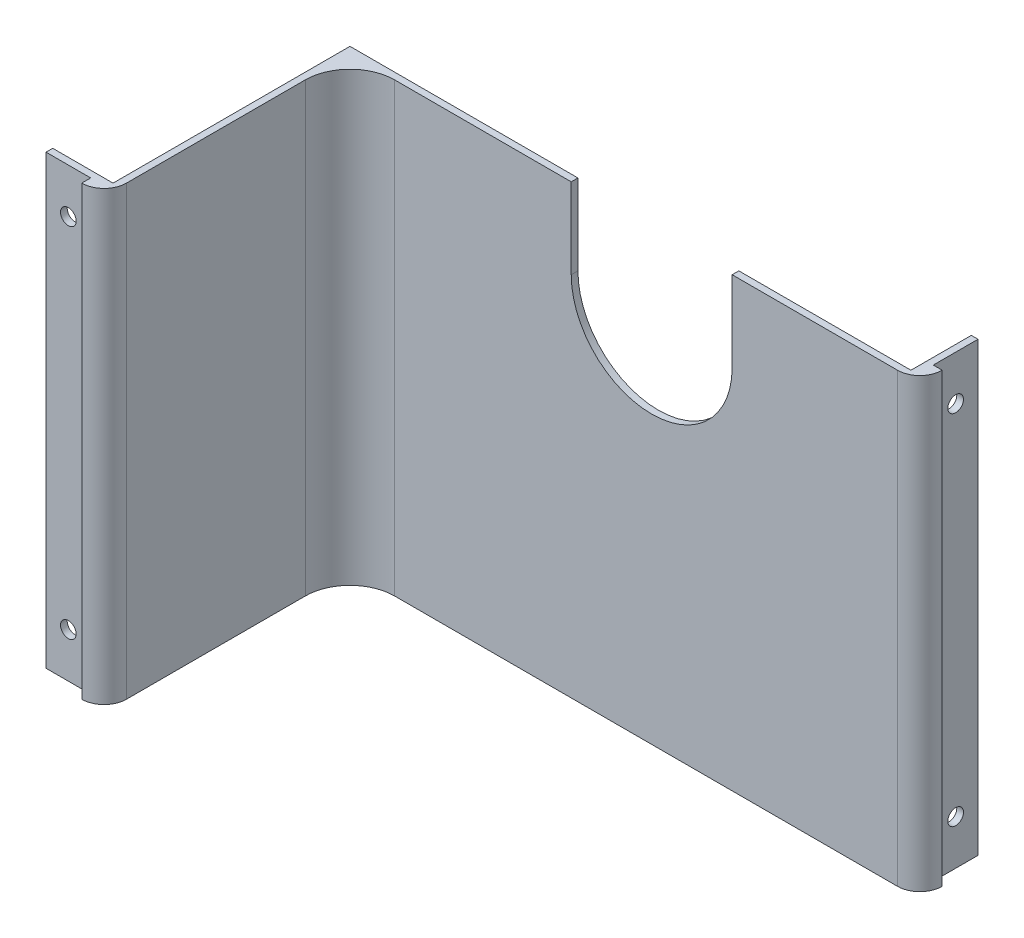
ISO-10303-21;
HEADER;
FILE_DESCRIPTION(('STEP AP214'),'2;1');
FILE_NAME('part.step','',(''),(''),'','','');
FILE_SCHEMA(('AUTOMOTIVE_DESIGN { 1 0 10303 214 1 1 1 1 }'));
ENDSEC;
DATA;
#1=APPLICATION_CONTEXT('core data for automotive mechanical design processes');
#2=APPLICATION_PROTOCOL_DEFINITION('international standard','automotive_design',2000,#1);
#3=PRODUCT_CONTEXT('',#1,'mechanical');
#4=PRODUCT('Part','Part','',(#3));
#5=PRODUCT_RELATED_PRODUCT_CATEGORY('part','',(#4));
#6=PRODUCT_DEFINITION_FORMATION('','',#4);
#7=PRODUCT_DEFINITION_CONTEXT('part definition',#1,'design');
#8=PRODUCT_DEFINITION('design','',#6,#7);
#9=PRODUCT_DEFINITION_SHAPE('','',#8);
#10=(LENGTH_UNIT() NAMED_UNIT(*) SI_UNIT(.MILLI.,.METRE.));
#11=(NAMED_UNIT(*) PLANE_ANGLE_UNIT() SI_UNIT($,.RADIAN.));
#12=(NAMED_UNIT(*) SI_UNIT($,.STERADIAN.) SOLID_ANGLE_UNIT());
#13=UNCERTAINTY_MEASURE_WITH_UNIT(LENGTH_MEASURE(1.E-05),#10,'distance_accuracy_value','');
#14=(GEOMETRIC_REPRESENTATION_CONTEXT(3) GLOBAL_UNCERTAINTY_ASSIGNED_CONTEXT((#13)) GLOBAL_UNIT_ASSIGNED_CONTEXT((#10,
#11,#12)) REPRESENTATION_CONTEXT('',''));
#15=CARTESIAN_POINT('',(0.,0.,0.));
#16=DIRECTION('',(0.,0.,1.));
#17=DIRECTION('',(1.,0.,0.));
#18=AXIS2_PLACEMENT_3D('',#15,#16,#17);
#19=CARTESIAN_POINT('',(-6.10622663543836E-13,100.,-4.99999999999999));
#20=DIRECTION('',(0.,1.,0.));
#21=DIRECTION('',(0.,0.,1.));
#22=AXIS2_PLACEMENT_3D('',#19,#20,#21);
#23=PLANE('',#22);
#24=DIRECTION('',(0.,0.,1.));
#25=VECTOR('',#24,1.);
#26=CARTESIAN_POINT('',(-73.,100.,-5.));
#27=LINE('',#26,#25);
#28=CARTESIAN_POINT('',(-73.,100.,-1.5));
#29=VERTEX_POINT('',#28);
#30=CARTESIAN_POINT('',(-73.0000000000003,100.,0.));
#31=VERTEX_POINT('',#30);
#32=EDGE_CURVE('E11',#29,#31,#27,.T.);
#33=ORIENTED_EDGE('',*,*,#32,.F.);
#34=DIRECTION('',(-1.,0.,0.));
#35=VECTOR('',#34,1.);
#36=CARTESIAN_POINT('',(-124.,100.,-1.49999999999999));
#37=LINE('',#36,#35);
#38=CARTESIAN_POINT('',(-124.,100.,-1.49999999999999));
#39=VERTEX_POINT('',#38);
#40=EDGE_CURVE('E302',#29,#39,#37,.T.);
#41=ORIENTED_EDGE('',*,*,#40,.T.);
#42=DIRECTION('',(0.,0.,1.));
#43=VECTOR('',#42,1.);
#44=CARTESIAN_POINT('',(-124.,100.,51.5));
#45=LINE('',#44,#43);
#46=CARTESIAN_POINT('',(-124.,100.,51.5));
#47=VERTEX_POINT('',#46);
#48=EDGE_CURVE('E306',#39,#47,#45,.T.);
#49=ORIENTED_EDGE('',*,*,#48,.T.);
#50=DIRECTION('',(-1.,0.,0.));
#51=VECTOR('',#50,1.);
#52=CARTESIAN_POINT('',(-137.5,100.,51.5));
#53=LINE('',#52,#51);
#54=CARTESIAN_POINT('',(-137.5,100.,51.5));
#55=VERTEX_POINT('',#54);
#56=EDGE_CURVE('E308',#47,#55,#53,.T.);
#57=ORIENTED_EDGE('',*,*,#56,.T.);
#58=DIRECTION('',(0.,0.,1.));
#59=VECTOR('',#58,1.);
#60=CARTESIAN_POINT('',(-137.5,100.,53.));
#61=LINE('',#60,#59);
#62=CARTESIAN_POINT('',(-137.5,100.,53.));
#63=VERTEX_POINT('',#62);
#64=EDGE_CURVE('E310',#55,#63,#61,.T.);
#65=ORIENTED_EDGE('',*,*,#64,.T.);
#66=DIRECTION('',(1.,0.,0.));
#67=VECTOR('',#66,1.);
#68=CARTESIAN_POINT('',(-127.5,100.,53.));
#69=LINE('',#68,#67);
#70=CARTESIAN_POINT('',(-127.5,100.,53.));
#71=VERTEX_POINT('',#70);
#72=EDGE_CURVE('E312',#63,#71,#69,.T.);
#73=ORIENTED_EDGE('',*,*,#72,.T.);
#74=DIRECTION('',(0.,0.,1.));
#75=VECTOR('',#74,1.);
#76=CARTESIAN_POINT('',(-127.5,100.,55.));
#77=LINE('',#76,#75);
#78=CARTESIAN_POINT('',(-127.5,100.,55.));
#79=VERTEX_POINT('',#78);
#80=EDGE_CURVE('E314',#71,#79,#77,.T.);
#81=ORIENTED_EDGE('',*,*,#80,.T.);
#82=CARTESIAN_POINT('',(-127.5,100.,50.));
#83=DIRECTION('',(0.,1.,0.));
#84=DIRECTION('',(0.,0.,-1.));
#85=AXIS2_PLACEMENT_3D('',#82,#83,#84);
#86=CIRCLE('',#85,5.00000000000001);
#87=CARTESIAN_POINT('',(-122.5,100.,50.));
#88=VERTEX_POINT('',#87);
#89=EDGE_CURVE('E168',#79,#88,#86,.T.);
#90=ORIENTED_EDGE('',*,*,#89,.T.);
#91=DIRECTION('',(0.,0.,-1.));
#92=VECTOR('',#91,1.);
#93=CARTESIAN_POINT('',(-122.5,100.,10.));
#94=LINE('',#93,#92);
#95=CARTESIAN_POINT('',(-122.5,100.,9.99999999999999));
#96=VERTEX_POINT('',#95);
#97=EDGE_CURVE('E160',#88,#96,#94,.T.);
#98=ORIENTED_EDGE('',*,*,#97,.T.);
#99=CARTESIAN_POINT('',(-112.5,100.,10.));
#100=DIRECTION('',(0.,-1.,0.));
#101=DIRECTION('',(0.,0.,1.));
#102=AXIS2_PLACEMENT_3D('',#99,#100,#101);
#103=CIRCLE('',#102,9.99999999999999);
#104=CARTESIAN_POINT('',(-112.5,100.,0.));
#105=VERTEX_POINT('',#104);
#106=EDGE_CURVE('E165',#96,#105,#103,.T.);
#107=ORIENTED_EDGE('',*,*,#106,.T.);
#108=DIRECTION('',(1.,0.,0.));
#109=VECTOR('',#108,1.);
#110=CARTESIAN_POINT('',(0.,100.,0.));
#111=LINE('',#110,#109);
#112=EDGE_CURVE('E186',#105,#31,#111,.T.);
#113=ORIENTED_EDGE('',*,*,#112,.T.);
#114=EDGE_LOOP('',(#33,#41,#49,#57,#65,#73,#81,#90,#98,#107,#113));
#115=FACE_BOUND('',#114,.T.);
#116=ADVANCED_FACE('F34',(#115),#23,.T.);
#117=CARTESIAN_POINT('',(-6.10622663543836E-13,100.,-4.99999999999999));
#118=DIRECTION('',(0.,-1.,0.));
#119=DIRECTION('',(0.,0.,-1.));
#120=AXIS2_PLACEMENT_3D('',#117,#118,#119);
#121=CYLINDRICAL_SURFACE('',#120,5.);
#122=CARTESIAN_POINT('',(-6.10622663543836E-13,3.05311331771918E-13,-5.));
#123=DIRECTION('',(0.,1.,0.));
#124=DIRECTION('',(0.,0.,1.));
#125=AXIS2_PLACEMENT_3D('',#122,#123,#124);
#126=CIRCLE('',#125,5.);
#127=CARTESIAN_POINT('',(0.,0.,0.));
#128=VERTEX_POINT('',#127);
#129=CARTESIAN_POINT('',(4.99999999999939,3.05311331771918E-13,-5.00000000000002));
#130=VERTEX_POINT('',#129);
#131=EDGE_CURVE('E191',#128,#130,#126,.T.);
#132=ORIENTED_EDGE('',*,*,#131,.T.);
#133=DIRECTION('',(0.,-1.,0.));
#134=VECTOR('',#133,1.);
#135=CARTESIAN_POINT('',(4.99999999999939,100.,-5.));
#136=LINE('',#135,#134);
#137=CARTESIAN_POINT('',(4.99999999999939,100.,-5.));
#138=VERTEX_POINT('',#137);
#139=EDGE_CURVE('E255',#138,#130,#136,.T.);
#140=ORIENTED_EDGE('',*,*,#139,.F.);
#141=CARTESIAN_POINT('',(-6.10622663543836E-13,100.,-4.99999999999999));
#142=DIRECTION('',(0.,1.,0.));
#143=DIRECTION('',(0.,0.,1.));
#144=AXIS2_PLACEMENT_3D('',#141,#142,#143);
#145=CIRCLE('',#144,5.);
#146=CARTESIAN_POINT('',(0.,100.,0.));
#147=VERTEX_POINT('',#146);
#148=EDGE_CURVE('E221',#147,#138,#145,.T.);
#149=ORIENTED_EDGE('',*,*,#148,.F.);
#150=DIRECTION('',(0.,-1.,0.));
#151=VECTOR('',#150,1.);
#152=CARTESIAN_POINT('',(0.,100.,0.));
#153=LINE('',#152,#151);
#154=EDGE_CURVE('E190',#147,#128,#153,.T.);
#155=ORIENTED_EDGE('',*,*,#154,.T.);
#156=EDGE_LOOP('',(#132,#140,#149,#155));
#157=FACE_BOUND('',#156,.T.);
#158=ADVANCED_FACE('F36',(#157),#121,.T.);
#159=CARTESIAN_POINT('',(4.99999999999939,100.,-5.));
#160=DIRECTION('',(0.,0.,1.));
#161=DIRECTION('',(1.,0.,0.));
#162=AXIS2_PLACEMENT_3D('',#159,#160,#161);
#163=PLANE('',#162);
#164=DIRECTION('',(-1.,0.,0.));
#165=VECTOR('',#164,1.);
#166=CARTESIAN_POINT('',(4.99999999999939,3.05311331771918E-13,-5.00000000000002));
#167=LINE('',#166,#165);
#168=CARTESIAN_POINT('',(2.99999999999939,3.05311331771918E-13,-5.));
#169=VERTEX_POINT('',#168);
#170=EDGE_CURVE('E194',#130,#169,#167,.T.);
#171=ORIENTED_EDGE('',*,*,#170,.T.);
#172=DIRECTION('',(0.,-1.,0.));
#173=VECTOR('',#172,1.);
#174=CARTESIAN_POINT('',(2.99999999999939,100.,-5.));
#175=LINE('',#174,#173);
#176=CARTESIAN_POINT('',(2.99999999999939,100.,-5.));
#177=VERTEX_POINT('',#176);
#178=EDGE_CURVE('E252',#177,#169,#175,.T.);
#179=ORIENTED_EDGE('',*,*,#178,.F.);
#180=DIRECTION('',(-1.,0.,0.));
#181=VECTOR('',#180,1.);
#182=CARTESIAN_POINT('',(4.99999999999939,100.,-5.));
#183=LINE('',#182,#181);
#184=EDGE_CURVE('E123',#138,#177,#183,.T.);
#185=ORIENTED_EDGE('',*,*,#184,.F.);
#186=ORIENTED_EDGE('',*,*,#139,.T.);
#187=EDGE_LOOP('',(#171,#179,#185,#186));
#188=FACE_BOUND('',#187,.T.);
#189=ADVANCED_FACE('F390',(#188),#163,.F.);
#190=CARTESIAN_POINT('',(2.99999999999939,100.,-5.));
#191=DIRECTION('',(-1.,0.,0.));
#192=DIRECTION('',(0.,0.,1.));
#193=AXIS2_PLACEMENT_3D('',#190,#191,#192);
#194=PLANE('',#193);
#195=CARTESIAN_POINT('',(2.99999999999998,90.,-10.));
#196=DIRECTION('',(1.,0.,0.));
#197=DIRECTION('',(0.,0.,-1.));
#198=AXIS2_PLACEMENT_3D('',#195,#196,#197);
#199=CIRCLE('',#198,1.75);
#200=CARTESIAN_POINT('',(2.99999999999998,90.,-11.75));
#201=VERTEX_POINT('',#200);
#202=EDGE_CURVE('E259',#201,#201,#199,.T.);
#203=ORIENTED_EDGE('',*,*,#202,.F.);
#204=EDGE_LOOP('',(#203));
#205=FACE_BOUND('',#204,.T.);
#206=CARTESIAN_POINT('',(2.99999999999998,9.99999999999999,-10.));
#207=DIRECTION('',(1.,0.,0.));
#208=DIRECTION('',(0.,0.,1.));
#209=AXIS2_PLACEMENT_3D('',#206,#207,#208);
#210=CIRCLE('',#209,1.75);
#211=CARTESIAN_POINT('',(2.99999999999998,9.99999999999999,-8.25000000000002));
#212=VERTEX_POINT('',#211);
#213=EDGE_CURVE('E265',#212,#212,#210,.T.);
#214=ORIENTED_EDGE('',*,*,#213,.F.);
#215=EDGE_LOOP('',(#214));
#216=FACE_BOUND('',#215,.T.);
#217=DIRECTION('',(0.,0.,-1.));
#218=VECTOR('',#217,1.);
#219=CARTESIAN_POINT('',(2.99999999999939,3.05311331771918E-13,-5.));
#220=LINE('',#219,#218);
#221=CARTESIAN_POINT('',(3.,3.05311331771918E-13,-15.));
#222=VERTEX_POINT('',#221);
#223=EDGE_CURVE('E197',#169,#222,#220,.T.);
#224=ORIENTED_EDGE('',*,*,#223,.T.);
#225=DIRECTION('',(0.,-1.,0.));
#226=VECTOR('',#225,1.);
#227=CARTESIAN_POINT('',(3.,100.,-15.));
#228=LINE('',#227,#226);
#229=CARTESIAN_POINT('',(3.,100.,-15.));
#230=VERTEX_POINT('',#229);
#231=EDGE_CURVE('E249',#230,#222,#228,.T.);
#232=ORIENTED_EDGE('',*,*,#231,.F.);
#233=DIRECTION('',(0.,0.,-1.));
#234=VECTOR('',#233,1.);
#235=CARTESIAN_POINT('',(2.99999999999939,100.,-5.));
#236=LINE('',#235,#234);
#237=EDGE_CURVE('E296',#177,#230,#236,.T.);
#238=ORIENTED_EDGE('',*,*,#237,.F.);
#239=ORIENTED_EDGE('',*,*,#178,.T.);
#240=EDGE_LOOP('',(#224,#232,#238,#239));
#241=FACE_BOUND('',#240,.T.);
#242=ADVANCED_FACE('F388',(#205,#216,#241),#194,.F.);
#243=CARTESIAN_POINT('',(3.,100.,-15.));
#244=DIRECTION('',(0.,0.,1.));
#245=DIRECTION('',(1.,0.,0.));
#246=AXIS2_PLACEMENT_3D('',#243,#244,#245);
#247=PLANE('',#246);
#248=DIRECTION('',(-1.,0.,0.));
#249=VECTOR('',#248,1.);
#250=CARTESIAN_POINT('',(3.,3.05311331771918E-13,-15.));
#251=LINE('',#250,#249);
#252=CARTESIAN_POINT('',(1.5,3.05311331771918E-13,-15.));
#253=VERTEX_POINT('',#252);
#254=EDGE_CURVE('E199',#222,#253,#251,.T.);
#255=ORIENTED_EDGE('',*,*,#254,.T.);
#256=DIRECTION('',(0.,-1.,0.));
#257=VECTOR('',#256,1.);
#258=CARTESIAN_POINT('',(1.5,100.,-15.));
#259=LINE('',#258,#257);
#260=CARTESIAN_POINT('',(1.5,100.,-15.));
#261=VERTEX_POINT('',#260);
#262=EDGE_CURVE('E246',#261,#253,#259,.T.);
#263=ORIENTED_EDGE('',*,*,#262,.F.);
#264=DIRECTION('',(-1.,0.,0.));
#265=VECTOR('',#264,1.);
#266=CARTESIAN_POINT('',(3.,100.,-15.));
#267=LINE('',#266,#265);
#268=EDGE_CURVE('E298',#230,#261,#267,.T.);
#269=ORIENTED_EDGE('',*,*,#268,.F.);
#270=ORIENTED_EDGE('',*,*,#231,.T.);
#271=EDGE_LOOP('',(#255,#263,#269,#270));
#272=FACE_BOUND('',#271,.T.);
#273=ADVANCED_FACE('F384',(#272),#247,.F.);
#274=CARTESIAN_POINT('',(1.5,100.,-15.));
#275=DIRECTION('',(1.,0.,0.));
#276=DIRECTION('',(0.,0.,-1.));
#277=AXIS2_PLACEMENT_3D('',#274,#275,#276);
#278=PLANE('',#277);
#279=CARTESIAN_POINT('',(1.49999999999997,90.,-10.));
#280=DIRECTION('',(1.,0.,0.));
#281=DIRECTION('',(0.,0.,-1.));
#282=AXIS2_PLACEMENT_3D('',#279,#280,#281);
#283=CIRCLE('',#282,1.75);
#284=CARTESIAN_POINT('',(1.49999999999997,90.,-11.75));
#285=VERTEX_POINT('',#284);
#286=EDGE_CURVE('E38',#285,#285,#283,.T.);
#287=ORIENTED_EDGE('',*,*,#286,.T.);
#288=EDGE_LOOP('',(#287));
#289=FACE_BOUND('',#288,.T.);
#290=CARTESIAN_POINT('',(1.49999999999997,9.99999999999999,-10.));
#291=DIRECTION('',(1.,0.,0.));
#292=DIRECTION('',(0.,0.,-1.));
#293=AXIS2_PLACEMENT_3D('',#290,#291,#292);
#294=CIRCLE('',#293,1.75);
#295=CARTESIAN_POINT('',(1.49999999999997,9.99999999999999,-11.75));
#296=VERTEX_POINT('',#295);
#297=EDGE_CURVE('E257',#296,#296,#294,.T.);
#298=ORIENTED_EDGE('',*,*,#297,.T.);
#299=EDGE_LOOP('',(#298));
#300=FACE_BOUND('',#299,.T.);
#301=DIRECTION('',(0.,0.,1.));
#302=VECTOR('',#301,1.);
#303=CARTESIAN_POINT('',(1.5,3.05311331771918E-13,-15.));
#304=LINE('',#303,#302);
#305=CARTESIAN_POINT('',(1.49999999999939,3.05311331771918E-13,-1.5));
#306=VERTEX_POINT('',#305);
#307=EDGE_CURVE('E201',#253,#306,#304,.T.);
#308=ORIENTED_EDGE('',*,*,#307,.T.);
#309=DIRECTION('',(0.,-1.,0.));
#310=VECTOR('',#309,1.);
#311=CARTESIAN_POINT('',(1.49999999999939,100.,-1.5));
#312=LINE('',#311,#310);
#313=CARTESIAN_POINT('',(1.49999999999939,100.,-1.5));
#314=VERTEX_POINT('',#313);
#315=EDGE_CURVE('E243',#314,#306,#312,.T.);
#316=ORIENTED_EDGE('',*,*,#315,.F.);
#317=DIRECTION('',(0.,0.,1.));
#318=VECTOR('',#317,1.);
#319=CARTESIAN_POINT('',(1.5,100.,-15.));
#320=LINE('',#319,#318);
#321=EDGE_CURVE('E300',#261,#314,#320,.T.);
#322=ORIENTED_EDGE('',*,*,#321,.F.);
#323=ORIENTED_EDGE('',*,*,#262,.T.);
#324=EDGE_LOOP('',(#308,#316,#322,#323));
#325=FACE_BOUND('',#324,.T.);
#326=ADVANCED_FACE('F380',(#289,#300,#325),#278,.F.);
#327=CARTESIAN_POINT('',(-124.,100.,-1.49999999999999));
#328=DIRECTION('',(0.,0.,1.));
#329=DIRECTION('',(1.,0.,0.));
#330=AXIS2_PLACEMENT_3D('',#327,#328,#329);
#331=PLANE('',#330);
#332=ORIENTED_EDGE('',*,*,#40,.F.);
#333=DIRECTION('',(0.,-1.,0.));
#334=VECTOR('',#333,1.);
#335=CARTESIAN_POINT('',(-73.,100.,-1.5));
#336=LINE('',#335,#334);
#337=CARTESIAN_POINT('',(-73.,82.,-1.5));
#338=VERTEX_POINT('',#337);
#339=EDGE_CURVE('E289',#29,#338,#336,.T.);
#340=ORIENTED_EDGE('',*,*,#339,.T.);
#341=CARTESIAN_POINT('',(-55.,82.0000008613909,-1.5));
#342=DIRECTION('',(0.,0.,1.));
#343=DIRECTION('',(1.,0.,0.));
#344=AXIS2_PLACEMENT_3D('',#341,#342,#343);
#345=CIRCLE('',#344,18.);
#346=CARTESIAN_POINT('',(-37.,82.0000017227817,-1.5));
#347=VERTEX_POINT('',#346);
#348=EDGE_CURVE('E195',#338,#347,#345,.T.);
#349=ORIENTED_EDGE('',*,*,#348,.T.);
#350=DIRECTION('',(0.,1.,0.));
#351=VECTOR('',#350,1.);
#352=CARTESIAN_POINT('',(-37.,100.,-1.5));
#353=LINE('',#352,#351);
#354=CARTESIAN_POINT('',(-37.,100.,-1.5));
#355=VERTEX_POINT('',#354);
#356=EDGE_CURVE('E285',#347,#355,#353,.T.);
#357=ORIENTED_EDGE('',*,*,#356,.T.);
#358=EDGE_CURVE('E303',#314,#355,#37,.T.);
#359=ORIENTED_EDGE('',*,*,#358,.F.);
#360=ORIENTED_EDGE('',*,*,#315,.T.);
#361=DIRECTION('',(-1.,0.,0.));
#362=VECTOR('',#361,1.);
#363=CARTESIAN_POINT('',(-124.,3.05311331771918E-13,-1.5));
#364=LINE('',#363,#362);
#365=CARTESIAN_POINT('',(-124.,3.05311331771918E-13,-1.5));
#366=VERTEX_POINT('',#365);
#367=EDGE_CURVE('E203',#306,#366,#364,.T.);
#368=ORIENTED_EDGE('',*,*,#367,.T.);
#369=DIRECTION('',(0.,-1.,0.));
#370=VECTOR('',#369,1.);
#371=CARTESIAN_POINT('',(-124.,100.,-1.49999999999999));
#372=LINE('',#371,#370);
#373=EDGE_CURVE('E240',#39,#366,#372,.T.);
#374=ORIENTED_EDGE('',*,*,#373,.F.);
#375=EDGE_LOOP('',(#332,#340,#349,#357,#359,#360,#368,#374));
#376=FACE_BOUND('',#375,.T.);
#377=ADVANCED_FACE('F353',(#376),#331,.F.);
#378=CARTESIAN_POINT('',(-124.,100.,51.5));
#379=DIRECTION('',(1.,0.,0.));
#380=DIRECTION('',(0.,0.,-1.));
#381=AXIS2_PLACEMENT_3D('',#378,#379,#380);
#382=PLANE('',#381);
#383=DIRECTION('',(0.,0.,1.));
#384=VECTOR('',#383,1.);
#385=CARTESIAN_POINT('',(-124.,0.,51.5));
#386=LINE('',#385,#384);
#387=CARTESIAN_POINT('',(-124.,0.,51.5));
#388=VERTEX_POINT('',#387);
#389=EDGE_CURVE('E205',#366,#388,#386,.T.);
#390=ORIENTED_EDGE('',*,*,#389,.T.);
#391=DIRECTION('',(0.,-1.,0.));
#392=VECTOR('',#391,1.);
#393=CARTESIAN_POINT('',(-124.,100.,51.5));
#394=LINE('',#393,#392);
#395=EDGE_CURVE('E237',#47,#388,#394,.T.);
#396=ORIENTED_EDGE('',*,*,#395,.F.);
#397=ORIENTED_EDGE('',*,*,#48,.F.);
#398=ORIENTED_EDGE('',*,*,#373,.T.);
#399=EDGE_LOOP('',(#390,#396,#397,#398));
#400=FACE_BOUND('',#399,.T.);
#401=ADVANCED_FACE('F360',(#400),#382,.F.);
#402=CARTESIAN_POINT('',(-137.5,100.,51.5));
#403=DIRECTION('',(0.,0.,1.));
#404=DIRECTION('',(1.,0.,0.));
#405=AXIS2_PLACEMENT_3D('',#402,#403,#404);
#406=PLANE('',#405);
#407=CARTESIAN_POINT('',(-132.5,90.,51.5));
#408=DIRECTION('',(0.,0.,1.));
#409=DIRECTION('',(1.,0.,0.));
#410=AXIS2_PLACEMENT_3D('',#407,#408,#409);
#411=CIRCLE('',#410,1.75000000000001);
#412=CARTESIAN_POINT('',(-130.75,90.,51.5));
#413=VERTEX_POINT('',#412);
#414=EDGE_CURVE('E270',#413,#413,#411,.T.);
#415=ORIENTED_EDGE('',*,*,#414,.T.);
#416=EDGE_LOOP('',(#415));
#417=FACE_BOUND('',#416,.T.);
#418=CARTESIAN_POINT('',(-132.5,9.99999999999999,51.5));
#419=DIRECTION('',(0.,0.,1.));
#420=DIRECTION('',(1.,0.,0.));
#421=AXIS2_PLACEMENT_3D('',#418,#419,#420);
#422=CIRCLE('',#421,1.75000000000001);
#423=CARTESIAN_POINT('',(-130.75,9.99999999999999,51.5));
#424=VERTEX_POINT('',#423);
#425=EDGE_CURVE('E579',#424,#424,#422,.T.);
#426=ORIENTED_EDGE('',*,*,#425,.T.);
#427=EDGE_LOOP('',(#426));
#428=FACE_BOUND('',#427,.T.);
#429=DIRECTION('',(-1.,0.,0.));
#430=VECTOR('',#429,1.);
#431=CARTESIAN_POINT('',(-137.5,0.,51.5));
#432=LINE('',#431,#430);
#433=CARTESIAN_POINT('',(-137.5,0.,51.5));
#434=VERTEX_POINT('',#433);
#435=EDGE_CURVE('E207',#388,#434,#432,.T.);
#436=ORIENTED_EDGE('',*,*,#435,.T.);
#437=DIRECTION('',(0.,-1.,0.));
#438=VECTOR('',#437,1.);
#439=CARTESIAN_POINT('',(-137.5,100.,51.5));
#440=LINE('',#439,#438);
#441=EDGE_CURVE('E234',#55,#434,#440,.T.);
#442=ORIENTED_EDGE('',*,*,#441,.F.);
#443=ORIENTED_EDGE('',*,*,#56,.F.);
#444=ORIENTED_EDGE('',*,*,#395,.T.);
#445=EDGE_LOOP('',(#436,#442,#443,#444));
#446=FACE_BOUND('',#445,.T.);
#447=ADVANCED_FACE('F364',(#417,#428,#446),#406,.F.);
#448=CARTESIAN_POINT('',(-137.5,100.,53.));
#449=DIRECTION('',(1.,0.,0.));
#450=DIRECTION('',(0.,0.,-1.));
#451=AXIS2_PLACEMENT_3D('',#448,#449,#450);
#452=PLANE('',#451);
#453=DIRECTION('',(0.,0.,1.));
#454=VECTOR('',#453,1.);
#455=CARTESIAN_POINT('',(-137.5,0.,53.));
#456=LINE('',#455,#454);
#457=CARTESIAN_POINT('',(-137.5,0.,53.));
#458=VERTEX_POINT('',#457);
#459=EDGE_CURVE('E209',#434,#458,#456,.T.);
#460=ORIENTED_EDGE('',*,*,#459,.T.);
#461=DIRECTION('',(0.,-1.,0.));
#462=VECTOR('',#461,1.);
#463=CARTESIAN_POINT('',(-137.5,100.,53.));
#464=LINE('',#463,#462);
#465=EDGE_CURVE('E231',#63,#458,#464,.T.);
#466=ORIENTED_EDGE('',*,*,#465,.F.);
#467=ORIENTED_EDGE('',*,*,#64,.F.);
#468=ORIENTED_EDGE('',*,*,#441,.T.);
#469=EDGE_LOOP('',(#460,#466,#467,#468));
#470=FACE_BOUND('',#469,.T.);
#471=ADVANCED_FACE('F369',(#470),#452,.F.);
#472=CARTESIAN_POINT('',(-127.5,100.,53.));
#473=DIRECTION('',(0.,0.,-1.));
#474=DIRECTION('',(-1.,0.,0.));
#475=AXIS2_PLACEMENT_3D('',#472,#473,#474);
#476=PLANE('',#475);
#477=CARTESIAN_POINT('',(-132.5,90.,53.0000000000001));
#478=DIRECTION('',(0.,0.,1.));
#479=DIRECTION('',(1.,0.,0.));
#480=AXIS2_PLACEMENT_3D('',#477,#478,#479);
#481=CIRCLE('',#480,1.75000000000001);
#482=CARTESIAN_POINT('',(-130.75,90.,53.0000000000001));
#483=VERTEX_POINT('',#482);
#484=EDGE_CURVE('E576',#483,#483,#481,.T.);
#485=ORIENTED_EDGE('',*,*,#484,.F.);
#486=EDGE_LOOP('',(#485));
#487=FACE_BOUND('',#486,.T.);
#488=CARTESIAN_POINT('',(-132.5,9.99999999999999,53.0000000000001));
#489=DIRECTION('',(0.,0.,1.));
#490=DIRECTION('',(-1.,0.,0.));
#491=AXIS2_PLACEMENT_3D('',#488,#489,#490);
#492=CIRCLE('',#491,1.75000000000001);
#493=CARTESIAN_POINT('',(-134.25,9.99999999999999,53.0000000000001));
#494=VERTEX_POINT('',#493);
#495=EDGE_CURVE('E583',#494,#494,#492,.T.);
#496=ORIENTED_EDGE('',*,*,#495,.F.);
#497=EDGE_LOOP('',(#496));
#498=FACE_BOUND('',#497,.T.);
#499=DIRECTION('',(1.,0.,0.));
#500=VECTOR('',#499,1.);
#501=CARTESIAN_POINT('',(-127.5,0.,53.));
#502=LINE('',#501,#500);
#503=CARTESIAN_POINT('',(-127.5,0.,53.));
#504=VERTEX_POINT('',#503);
#505=EDGE_CURVE('E211',#458,#504,#502,.T.);
#506=ORIENTED_EDGE('',*,*,#505,.T.);
#507=DIRECTION('',(0.,-1.,0.));
#508=VECTOR('',#507,1.);
#509=CARTESIAN_POINT('',(-127.5,100.,53.));
#510=LINE('',#509,#508);
#511=EDGE_CURVE('E228',#71,#504,#510,.T.);
#512=ORIENTED_EDGE('',*,*,#511,.F.);
#513=ORIENTED_EDGE('',*,*,#72,.F.);
#514=ORIENTED_EDGE('',*,*,#465,.T.);
#515=EDGE_LOOP('',(#506,#512,#513,#514));
#516=FACE_BOUND('',#515,.T.);
#517=ADVANCED_FACE('F372',(#487,#498,#516),#476,.F.);
#518=CARTESIAN_POINT('',(-127.5,100.,55.));
#519=DIRECTION('',(1.,0.,0.));
#520=DIRECTION('',(0.,0.,-1.));
#521=AXIS2_PLACEMENT_3D('',#518,#519,#520);
#522=PLANE('',#521);
#523=DIRECTION('',(0.,0.,1.));
#524=VECTOR('',#523,1.);
#525=CARTESIAN_POINT('',(-127.5,0.,55.));
#526=LINE('',#525,#524);
#527=CARTESIAN_POINT('',(-127.5,0.,55.));
#528=VERTEX_POINT('',#527);
#529=EDGE_CURVE('E213',#504,#528,#526,.T.);
#530=ORIENTED_EDGE('',*,*,#529,.T.);
#531=DIRECTION('',(0.,-1.,0.));
#532=VECTOR('',#531,1.);
#533=CARTESIAN_POINT('',(-127.5,100.,55.));
#534=LINE('',#533,#532);
#535=EDGE_CURVE('E225',#79,#528,#534,.T.);
#536=ORIENTED_EDGE('',*,*,#535,.F.);
#537=ORIENTED_EDGE('',*,*,#80,.F.);
#538=ORIENTED_EDGE('',*,*,#511,.T.);
#539=EDGE_LOOP('',(#530,#536,#537,#538));
#540=FACE_BOUND('',#539,.T.);
#541=ADVANCED_FACE('F320',(#540),#522,.F.);
#542=CARTESIAN_POINT('',(-127.5,100.,50.));
#543=DIRECTION('',(0.,-1.,0.));
#544=DIRECTION('',(0.,0.,-1.));
#545=AXIS2_PLACEMENT_3D('',#542,#543,#544);
#546=CYLINDRICAL_SURFACE('',#545,5.00000000000001);
#547=CARTESIAN_POINT('',(-127.5,3.05311331771918E-13,50.));
#548=DIRECTION('',(0.,1.,0.));
#549=DIRECTION('',(0.,0.,-1.));
#550=AXIS2_PLACEMENT_3D('',#547,#548,#549);
#551=CIRCLE('',#550,5.00000000000001);
#552=CARTESIAN_POINT('',(-122.5,3.05311331771918E-13,50.));
#553=VERTEX_POINT('',#552);
#554=EDGE_CURVE('E215',#528,#553,#551,.T.);
#555=ORIENTED_EDGE('',*,*,#554,.T.);
#556=DIRECTION('',(0.,-1.,0.));
#557=VECTOR('',#556,1.);
#558=CARTESIAN_POINT('',(-122.5,100.,50.));
#559=LINE('',#558,#557);
#560=EDGE_CURVE('E180',#88,#553,#559,.T.);
#561=ORIENTED_EDGE('',*,*,#560,.F.);
#562=ORIENTED_EDGE('',*,*,#89,.F.);
#563=ORIENTED_EDGE('',*,*,#535,.T.);
#564=EDGE_LOOP('',(#555,#561,#562,#563));
#565=FACE_BOUND('',#564,.T.);
#566=ADVANCED_FACE('F324',(#565),#546,.T.);
#567=CARTESIAN_POINT('',(-122.5,100.,10.));
#568=DIRECTION('',(-1.,0.,0.));
#569=DIRECTION('',(0.,0.,1.));
#570=AXIS2_PLACEMENT_3D('',#567,#568,#569);
#571=PLANE('',#570);
#572=DIRECTION('',(0.,0.,-1.));
#573=VECTOR('',#572,1.);
#574=CARTESIAN_POINT('',(-122.5,0.,10.));
#575=LINE('',#574,#573);
#576=CARTESIAN_POINT('',(-122.5,0.,10.));
#577=VERTEX_POINT('',#576);
#578=EDGE_CURVE('E177',#553,#577,#575,.T.);
#579=ORIENTED_EDGE('',*,*,#578,.T.);
#580=DIRECTION('',(0.,-1.,0.));
#581=VECTOR('',#580,1.);
#582=CARTESIAN_POINT('',(-122.5,100.,9.99999999999999));
#583=LINE('',#582,#581);
#584=EDGE_CURVE('E174',#96,#577,#583,.T.);
#585=ORIENTED_EDGE('',*,*,#584,.F.);
#586=ORIENTED_EDGE('',*,*,#97,.F.);
#587=ORIENTED_EDGE('',*,*,#560,.T.);
#588=EDGE_LOOP('',(#579,#585,#586,#587));
#589=FACE_BOUND('',#588,.T.);
#590=ADVANCED_FACE('F175',(#589),#571,.F.);
#591=CARTESIAN_POINT('',(-112.5,100.,10.));
#592=DIRECTION('',(0.,-1.,0.));
#593=DIRECTION('',(0.,0.,-1.));
#594=AXIS2_PLACEMENT_3D('',#591,#592,#593);
#595=CYLINDRICAL_SURFACE('',#594,9.99999999999999);
#596=CARTESIAN_POINT('',(-112.5,0.,10.));
#597=DIRECTION('',(0.,-1.,0.));
#598=DIRECTION('',(0.,0.,1.));
#599=AXIS2_PLACEMENT_3D('',#596,#597,#598);
#600=CIRCLE('',#599,9.99999999999999);
#601=CARTESIAN_POINT('',(-112.5,0.,0.));
#602=VERTEX_POINT('',#601);
#603=EDGE_CURVE('E218',#577,#602,#600,.T.);
#604=ORIENTED_EDGE('',*,*,#603,.T.);
#605=DIRECTION('',(0.,-1.,0.));
#606=VECTOR('',#605,1.);
#607=CARTESIAN_POINT('',(-112.5,100.,0.));
#608=LINE('',#607,#606);
#609=EDGE_CURVE('E181',#105,#602,#608,.T.);
#610=ORIENTED_EDGE('',*,*,#609,.F.);
#611=ORIENTED_EDGE('',*,*,#106,.F.);
#612=ORIENTED_EDGE('',*,*,#584,.T.);
#613=EDGE_LOOP('',(#604,#610,#611,#612));
#614=FACE_BOUND('',#613,.T.);
#615=ADVANCED_FACE('F183',(#614),#595,.F.);
#616=CARTESIAN_POINT('',(0.,100.,0.));
#617=DIRECTION('',(0.,0.,-1.));
#618=DIRECTION('',(-1.,0.,0.));
#619=AXIS2_PLACEMENT_3D('',#616,#617,#618);
#620=PLANE('',#619);
#621=CARTESIAN_POINT('',(-55.,82.0000008613909,0.));
#622=DIRECTION('',(0.,0.,1.));
#623=DIRECTION('',(1.,0.,0.));
#624=AXIS2_PLACEMENT_3D('',#621,#622,#623);
#625=CIRCLE('',#624,18.);
#626=CARTESIAN_POINT('',(-73.0000000000003,82.,0.));
#627=VERTEX_POINT('',#626);
#628=CARTESIAN_POINT('',(-37.,82.0000017227817,0.));
#629=VERTEX_POINT('',#628);
#630=EDGE_CURVE('E263',#627,#629,#625,.T.);
#631=ORIENTED_EDGE('',*,*,#630,.F.);
#632=DIRECTION('',(0.,-1.,0.));
#633=VECTOR('',#632,1.);
#634=CARTESIAN_POINT('',(-73.0000000000003,82.,0.));
#635=LINE('',#634,#633);
#636=EDGE_CURVE('E278',#31,#627,#635,.T.);
#637=ORIENTED_EDGE('',*,*,#636,.F.);
#638=ORIENTED_EDGE('',*,*,#112,.F.);
#639=ORIENTED_EDGE('',*,*,#609,.T.);
#640=DIRECTION('',(1.,0.,0.));
#641=VECTOR('',#640,1.);
#642=CARTESIAN_POINT('',(0.,0.,0.));
#643=LINE('',#642,#641);
#644=EDGE_CURVE('E114',#602,#128,#643,.T.);
#645=ORIENTED_EDGE('',*,*,#644,.T.);
#646=ORIENTED_EDGE('',*,*,#154,.F.);
#647=CARTESIAN_POINT('',(-37.,100.,0.));
#648=VERTEX_POINT('',#647);
#649=EDGE_CURVE('E59',#648,#147,#111,.T.);
#650=ORIENTED_EDGE('',*,*,#649,.F.);
#651=DIRECTION('',(0.,1.,0.));
#652=VECTOR('',#651,1.);
#653=CARTESIAN_POINT('',(-37.,100.,0.));
#654=LINE('',#653,#652);
#655=EDGE_CURVE('E51',#629,#648,#654,.T.);
#656=ORIENTED_EDGE('',*,*,#655,.F.);
#657=EDGE_LOOP('',(#631,#637,#638,#639,#645,#646,#650,#656));
#658=FACE_BOUND('',#657,.T.);
#659=ADVANCED_FACE('F329',(#658),#620,.F.);
#660=DIRECTION('',(0.,0.,-1.));
#661=VECTOR('',#660,1.);
#662=CARTESIAN_POINT('',(-37.0000000000006,100.,-5.));
#663=LINE('',#662,#661);
#664=EDGE_CURVE('E43',#648,#355,#663,.T.);
#665=ORIENTED_EDGE('',*,*,#664,.F.);
#666=ORIENTED_EDGE('',*,*,#649,.T.);
#667=ORIENTED_EDGE('',*,*,#148,.T.);
#668=ORIENTED_EDGE('',*,*,#184,.T.);
#669=ORIENTED_EDGE('',*,*,#237,.T.);
#670=ORIENTED_EDGE('',*,*,#268,.T.);
#671=ORIENTED_EDGE('',*,*,#321,.T.);
#672=ORIENTED_EDGE('',*,*,#358,.T.);
#673=EDGE_LOOP('',(#665,#666,#667,#668,#669,#670,#671,#672));
#674=FACE_BOUND('',#673,.T.);
#675=ADVANCED_FACE('F394',(#674),#23,.T.);
#676=CARTESIAN_POINT('',(-6.10622663543836E-13,3.05311331771918E-13,-5.));
#677=DIRECTION('',(0.,1.,0.));
#678=DIRECTION('',(0.,0.,1.));
#679=AXIS2_PLACEMENT_3D('',#676,#677,#678);
#680=PLANE('',#679);
#681=ORIENTED_EDGE('',*,*,#131,.F.);
#682=ORIENTED_EDGE('',*,*,#644,.F.);
#683=ORIENTED_EDGE('',*,*,#603,.F.);
#684=ORIENTED_EDGE('',*,*,#578,.F.);
#685=ORIENTED_EDGE('',*,*,#554,.F.);
#686=ORIENTED_EDGE('',*,*,#529,.F.);
#687=ORIENTED_EDGE('',*,*,#505,.F.);
#688=ORIENTED_EDGE('',*,*,#459,.F.);
#689=ORIENTED_EDGE('',*,*,#435,.F.);
#690=ORIENTED_EDGE('',*,*,#389,.F.);
#691=ORIENTED_EDGE('',*,*,#367,.F.);
#692=ORIENTED_EDGE('',*,*,#307,.F.);
#693=ORIENTED_EDGE('',*,*,#254,.F.);
#694=ORIENTED_EDGE('',*,*,#223,.F.);
#695=ORIENTED_EDGE('',*,*,#170,.F.);
#696=EDGE_LOOP('',(#681,#682,#683,#684,#685,#686,#687,#688,#689,#690,#691,#692,#693,#694,#695));
#697=FACE_BOUND('',#696,.T.);
#698=ADVANCED_FACE('F327',(#697),#680,.F.);
#699=CARTESIAN_POINT('',(-55.,82.0000008613909,-10.));
#700=DIRECTION('',(0.,0.,1.));
#701=DIRECTION('',(1.,0.,0.));
#702=AXIS2_PLACEMENT_3D('',#699,#700,#701);
#703=CYLINDRICAL_SURFACE('',#702,18.);
#704=DIRECTION('',(0.,0.,1.));
#705=VECTOR('',#704,1.);
#706=CARTESIAN_POINT('',(-73.0000000000003,82.,-10.));
#707=LINE('',#706,#705);
#708=EDGE_CURVE('E282',#338,#627,#707,.T.);
#709=ORIENTED_EDGE('',*,*,#708,.T.);
#710=ORIENTED_EDGE('',*,*,#630,.T.);
#711=DIRECTION('',(0.,0.,1.));
#712=VECTOR('',#711,1.);
#713=CARTESIAN_POINT('',(-37.,82.0000017227817,-10.));
#714=LINE('',#713,#712);
#715=EDGE_CURVE('E281',#347,#629,#714,.T.);
#716=ORIENTED_EDGE('',*,*,#715,.F.);
#717=ORIENTED_EDGE('',*,*,#348,.F.);
#718=EDGE_LOOP('',(#709,#710,#716,#717));
#719=FACE_BOUND('',#718,.T.);
#720=ADVANCED_FACE('F350',(#719),#703,.F.);
#721=CARTESIAN_POINT('',(-73.0000000000003,82.,-10.));
#722=DIRECTION('',(-1.,0.,0.));
#723=DIRECTION('',(0.,0.,1.));
#724=AXIS2_PLACEMENT_3D('',#721,#722,#723);
#725=PLANE('',#724);
#726=ORIENTED_EDGE('',*,*,#32,.T.);
#727=ORIENTED_EDGE('',*,*,#636,.T.);
#728=ORIENTED_EDGE('',*,*,#708,.F.);
#729=ORIENTED_EDGE('',*,*,#339,.F.);
#730=EDGE_LOOP('',(#726,#727,#728,#729));
#731=FACE_BOUND('',#730,.T.);
#732=ADVANCED_FACE('F352',(#731),#725,.F.);
#733=CARTESIAN_POINT('',(-37.,100.,-10.));
#734=DIRECTION('',(1.,0.,0.));
#735=DIRECTION('',(0.,0.,-1.));
#736=AXIS2_PLACEMENT_3D('',#733,#734,#735);
#737=PLANE('',#736);
#738=ORIENTED_EDGE('',*,*,#715,.T.);
#739=ORIENTED_EDGE('',*,*,#655,.T.);
#740=ORIENTED_EDGE('',*,*,#664,.T.);
#741=ORIENTED_EDGE('',*,*,#356,.F.);
#742=EDGE_LOOP('',(#738,#739,#740,#741));
#743=FACE_BOUND('',#742,.T.);
#744=ADVANCED_FACE('F395',(#743),#737,.F.);
#745=CARTESIAN_POINT('',(-7.00000000000001,9.99999999999999,-10.));
#746=DIRECTION('',(1.,0.,0.));
#747=DIRECTION('',(0.,0.,-1.));
#748=AXIS2_PLACEMENT_3D('',#745,#746,#747);
#749=CYLINDRICAL_SURFACE('',#748,1.75);
#750=ORIENTED_EDGE('',*,*,#213,.T.);
#751=EDGE_LOOP('',(#750));
#752=FACE_BOUND('',#751,.T.);
#753=ORIENTED_EDGE('',*,*,#297,.F.);
#754=EDGE_LOOP('',(#753));
#755=FACE_BOUND('',#754,.T.);
#756=ADVANCED_FACE('F397',(#752,#755),#749,.F.);
#757=CARTESIAN_POINT('',(-7.00000000000001,90.,-10.));
#758=DIRECTION('',(1.,0.,0.));
#759=DIRECTION('',(0.,0.,-1.));
#760=AXIS2_PLACEMENT_3D('',#757,#758,#759);
#761=CYLINDRICAL_SURFACE('',#760,1.75);
#762=ORIENTED_EDGE('',*,*,#202,.T.);
#763=EDGE_LOOP('',(#762));
#764=FACE_BOUND('',#763,.T.);
#765=ORIENTED_EDGE('',*,*,#286,.F.);
#766=EDGE_LOOP('',(#765));
#767=FACE_BOUND('',#766,.T.);
#768=ADVANCED_FACE('F403',(#764,#767),#761,.F.);
#769=CARTESIAN_POINT('',(-132.5,9.99999999999999,43.0000000000001));
#770=DIRECTION('',(0.,0.,1.));
#771=DIRECTION('',(1.,0.,0.));
#772=AXIS2_PLACEMENT_3D('',#769,#770,#771);
#773=CYLINDRICAL_SURFACE('',#772,1.75000000000001);
#774=ORIENTED_EDGE('',*,*,#495,.T.);
#775=EDGE_LOOP('',(#774));
#776=FACE_BOUND('',#775,.T.);
#777=ORIENTED_EDGE('',*,*,#425,.F.);
#778=EDGE_LOOP('',(#777));
#779=FACE_BOUND('',#778,.T.);
#780=ADVANCED_FACE('F550',(#776,#779),#773,.F.);
#781=CARTESIAN_POINT('',(-132.5,90.,43.0000000000001));
#782=DIRECTION('',(0.,0.,1.));
#783=DIRECTION('',(1.,0.,0.));
#784=AXIS2_PLACEMENT_3D('',#781,#782,#783);
#785=CYLINDRICAL_SURFACE('',#784,1.75000000000001);
#786=ORIENTED_EDGE('',*,*,#484,.T.);
#787=EDGE_LOOP('',(#786));
#788=FACE_BOUND('',#787,.T.);
#789=ORIENTED_EDGE('',*,*,#414,.F.);
#790=EDGE_LOOP('',(#789));
#791=FACE_BOUND('',#790,.T.);
#792=ADVANCED_FACE('F559',(#788,#791),#785,.F.);
#793=CLOSED_SHELL('',(#116,#158,#189,#242,#273,#326,#377,#401,#447,#471,#517,#541,#566,#590,
#615,#659,#675,#698,#720,#732,#744,#756,#768,#780,#792));
#794=MANIFOLD_SOLID_BREP('B2',#793);
#795=ADVANCED_BREP_SHAPE_REPRESENTATION('',(#18,#794),#14);
#796=SHAPE_DEFINITION_REPRESENTATION(#9,#795);
ENDSEC;
END-ISO-10303-21;
